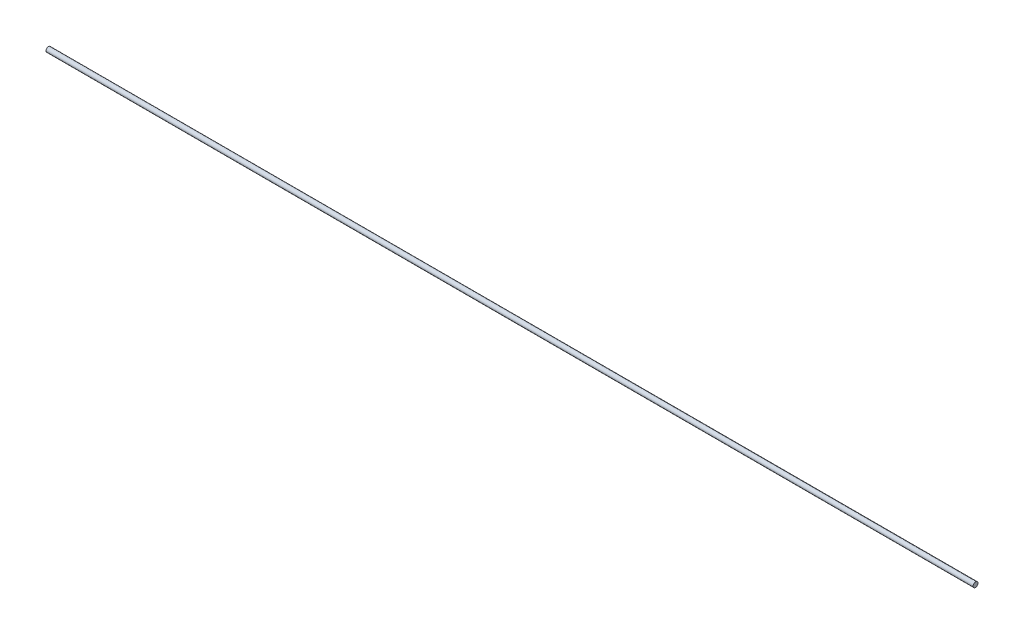
ISO-10303-21;
HEADER;
FILE_DESCRIPTION(('STEP AP214'),'2;1');
FILE_NAME('part.step','',(''),(''),'','','');
FILE_SCHEMA(('AUTOMOTIVE_DESIGN { 1 0 10303 214 1 1 1 1 }'));
ENDSEC;
DATA;
#1=APPLICATION_CONTEXT('core data for automotive mechanical design processes');
#2=APPLICATION_PROTOCOL_DEFINITION('international standard','automotive_design',2000,#1);
#3=PRODUCT_CONTEXT('',#1,'mechanical');
#4=PRODUCT('Part','Part','',(#3));
#5=PRODUCT_RELATED_PRODUCT_CATEGORY('part','',(#4));
#6=PRODUCT_DEFINITION_FORMATION('','',#4);
#7=PRODUCT_DEFINITION_CONTEXT('part definition',#1,'design');
#8=PRODUCT_DEFINITION('design','',#6,#7);
#9=PRODUCT_DEFINITION_SHAPE('','',#8);
#10=(LENGTH_UNIT() NAMED_UNIT(*) SI_UNIT(.MILLI.,.METRE.));
#11=(NAMED_UNIT(*) PLANE_ANGLE_UNIT() SI_UNIT($,.RADIAN.));
#12=(NAMED_UNIT(*) SI_UNIT($,.STERADIAN.) SOLID_ANGLE_UNIT());
#13=UNCERTAINTY_MEASURE_WITH_UNIT(LENGTH_MEASURE(1.E-05),#10,'distance_accuracy_value','');
#14=(GEOMETRIC_REPRESENTATION_CONTEXT(3) GLOBAL_UNCERTAINTY_ASSIGNED_CONTEXT((#13)) GLOBAL_UNIT_ASSIGNED_CONTEXT((#10,
#11,#12)) REPRESENTATION_CONTEXT('',''));
#15=CARTESIAN_POINT('',(0.,0.,0.));
#16=DIRECTION('',(0.,0.,1.));
#17=DIRECTION('',(1.,0.,0.));
#18=AXIS2_PLACEMENT_3D('',#15,#16,#17);
#19=CARTESIAN_POINT('',(1531.,0.,0.));
#20=DIRECTION('',(-1.,0.,0.));
#21=DIRECTION('',(0.,0.,1.));
#22=AXIS2_PLACEMENT_3D('',#19,#20,#21);
#23=CYLINDRICAL_SURFACE('',#22,4.);
#24=CARTESIAN_POINT('',(1531.,0.,0.));
#25=DIRECTION('',(1.,0.,0.));
#26=DIRECTION('',(0.,0.,-1.));
#27=AXIS2_PLACEMENT_3D('',#24,#25,#26);
#28=CIRCLE('',#27,4.);
#29=CARTESIAN_POINT('',(1531.,0.,-4.));
#30=VERTEX_POINT('',#29);
#31=EDGE_CURVE('E9',#30,#30,#28,.T.);
#32=ORIENTED_EDGE('',*,*,#31,.F.);
#33=EDGE_LOOP('',(#32));
#34=FACE_BOUND('',#33,.T.);
#35=CARTESIAN_POINT('',(0.,0.,0.));
#36=DIRECTION('',(1.,0.,0.));
#37=DIRECTION('',(0.,0.,-1.));
#38=AXIS2_PLACEMENT_3D('',#35,#36,#37);
#39=CIRCLE('',#38,4.);
#40=CARTESIAN_POINT('',(0.,0.,-4.));
#41=VERTEX_POINT('',#40);
#42=EDGE_CURVE('E17',#41,#41,#39,.T.);
#43=ORIENTED_EDGE('',*,*,#42,.T.);
#44=EDGE_LOOP('',(#43));
#45=FACE_BOUND('',#44,.T.);
#46=ADVANCED_FACE('F14',(#34,#45),#23,.T.);
#47=CARTESIAN_POINT('',(1531.,0.,0.));
#48=DIRECTION('',(1.,0.,0.));
#49=DIRECTION('',(0.,0.,-1.));
#50=AXIS2_PLACEMENT_3D('',#47,#48,#49);
#51=PLANE('',#50);
#52=ORIENTED_EDGE('',*,*,#31,.T.);
#53=EDGE_LOOP('',(#52));
#54=FACE_BOUND('',#53,.T.);
#55=ADVANCED_FACE('F29',(#54),#51,.T.);
#56=CARTESIAN_POINT('',(0.,0.,0.));
#57=DIRECTION('',(1.,0.,0.));
#58=DIRECTION('',(0.,0.,-1.));
#59=AXIS2_PLACEMENT_3D('',#56,#57,#58);
#60=PLANE('',#59);
#61=ORIENTED_EDGE('',*,*,#42,.F.);
#62=EDGE_LOOP('',(#61));
#63=FACE_BOUND('',#62,.T.);
#64=ADVANCED_FACE('F27',(#63),#60,.F.);
#65=CLOSED_SHELL('',(#46,#55,#64));
#66=MANIFOLD_SOLID_BREP('B1',#65);
#67=ADVANCED_BREP_SHAPE_REPRESENTATION('',(#18,#66),#14);
#68=SHAPE_DEFINITION_REPRESENTATION(#9,#67);
ENDSEC;
END-ISO-10303-21;
